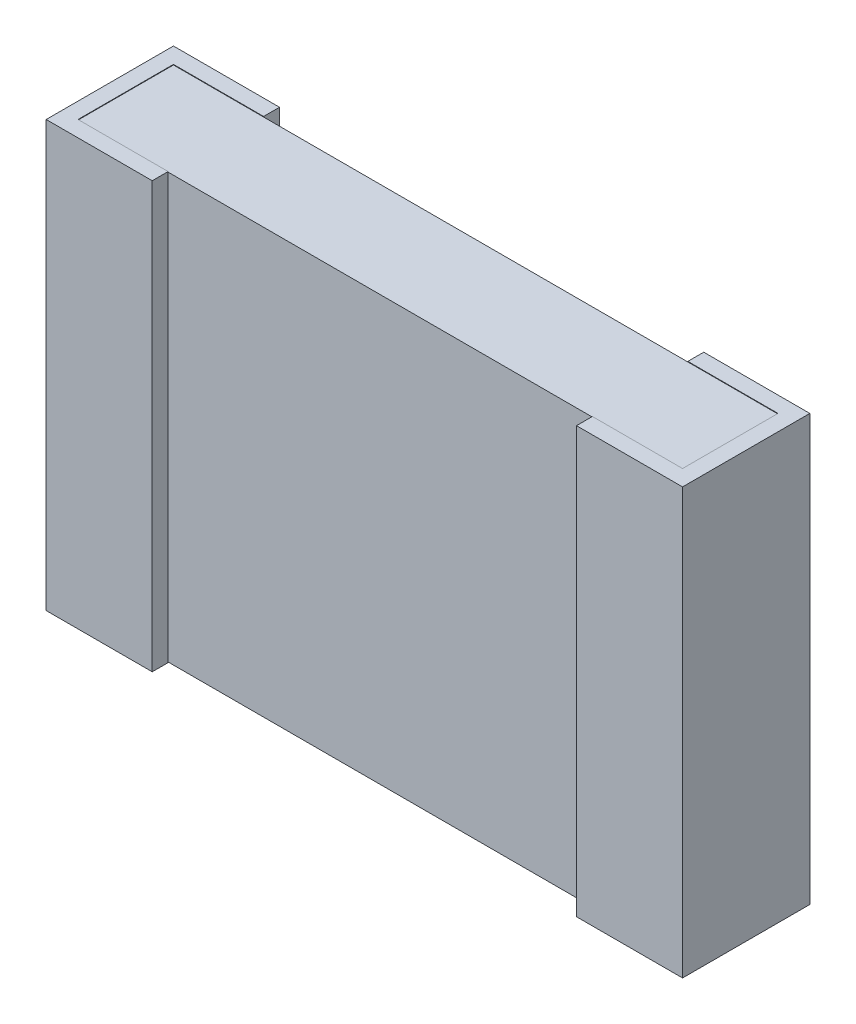
ISO-10303-21;
HEADER;
FILE_DESCRIPTION(('STEP AP214'),'2;1');
FILE_NAME('part.step','',(''),(''),'','','');
FILE_SCHEMA(('AUTOMOTIVE_DESIGN { 1 0 10303 214 1 1 1 1 }'));
ENDSEC;
DATA;
#1=APPLICATION_CONTEXT('core data for automotive mechanical design processes');
#2=APPLICATION_PROTOCOL_DEFINITION('international standard','automotive_design',2000,#1);
#3=PRODUCT_CONTEXT('',#1,'mechanical');
#4=PRODUCT('Part','Part','',(#3));
#5=PRODUCT_RELATED_PRODUCT_CATEGORY('part','',(#4));
#6=PRODUCT_DEFINITION_FORMATION('','',#4);
#7=PRODUCT_DEFINITION_CONTEXT('part definition',#1,'design');
#8=PRODUCT_DEFINITION('design','',#6,#7);
#9=PRODUCT_DEFINITION_SHAPE('','',#8);
#10=(LENGTH_UNIT() NAMED_UNIT(*) SI_UNIT(.MILLI.,.METRE.));
#11=(NAMED_UNIT(*) PLANE_ANGLE_UNIT() SI_UNIT($,.RADIAN.));
#12=(NAMED_UNIT(*) SI_UNIT($,.STERADIAN.) SOLID_ANGLE_UNIT());
#13=UNCERTAINTY_MEASURE_WITH_UNIT(LENGTH_MEASURE(1.E-05),#10,'distance_accuracy_value','');
#14=(GEOMETRIC_REPRESENTATION_CONTEXT(3) GLOBAL_UNCERTAINTY_ASSIGNED_CONTEXT((#13)) GLOBAL_UNIT_ASSIGNED_CONTEXT((#10,
#11,#12)) REPRESENTATION_CONTEXT('',''));
#15=CARTESIAN_POINT('',(0.,0.,0.));
#16=DIRECTION('',(0.,0.,1.));
#17=DIRECTION('',(1.,0.,0.));
#18=AXIS2_PLACEMENT_3D('',#15,#16,#17);
#19=CARTESIAN_POINT('',(0.,-1.01854,0.609599999999878));
#20=DIRECTION('',(0.,0.,1.));
#21=DIRECTION('',(1.,0.,0.));
#22=AXIS2_PLACEMENT_3D('',#19,#20,#21);
#23=PLANE('',#22);
#24=DIRECTION('',(1.,0.,0.));
#25=VECTOR('',#24,1.);
#26=CARTESIAN_POINT('',(0.,-1.01854,0.609599999999878));
#27=LINE('',#26,#25);
#28=CARTESIAN_POINT('',(0.,-1.01854,0.609599999999878));
#29=VERTEX_POINT('',#28);
#30=CARTESIAN_POINT('',(0.508,-1.01854,0.609599999999878));
#31=VERTEX_POINT('',#30);
#32=EDGE_CURVE('E190',#29,#31,#27,.T.);
#33=ORIENTED_EDGE('',*,*,#32,.T.);
#34=DIRECTION('',(0.,1.,0.));
#35=VECTOR('',#34,1.);
#36=CARTESIAN_POINT('',(0.508,-1.01854,0.609599999999878));
#37=LINE('',#36,#35);
#38=CARTESIAN_POINT('',(0.508,1.01854,0.609599999999878));
#39=VERTEX_POINT('',#38);
#40=EDGE_CURVE('E202',#39,#31,#37,.F.);
#41=ORIENTED_EDGE('',*,*,#40,.F.);
#42=DIRECTION('',(1.,0.,0.));
#43=VECTOR('',#42,1.);
#44=CARTESIAN_POINT('',(0.,1.01854,0.609599999999878));
#45=LINE('',#44,#43);
#46=CARTESIAN_POINT('',(0.,1.01854,0.609599999999878));
#47=VERTEX_POINT('',#46);
#48=EDGE_CURVE('E20',#39,#47,#45,.F.);
#49=ORIENTED_EDGE('',*,*,#48,.T.);
#50=DIRECTION('',(0.,1.,0.));
#51=VECTOR('',#50,1.);
#52=CARTESIAN_POINT('',(0.,-1.01854,0.609599999999878));
#53=LINE('',#52,#51);
#54=EDGE_CURVE('E205',#29,#47,#53,.T.);
#55=ORIENTED_EDGE('',*,*,#54,.F.);
#56=EDGE_LOOP('',(#33,#41,#49,#55));
#57=FACE_BOUND('',#56,.T.);
#58=ADVANCED_FACE('F17',(#57),#23,.T.);
#59=CARTESIAN_POINT('',(3.048,-1.01854,0.609599999999878));
#60=DIRECTION('',(0.,0.,-1.));
#61=DIRECTION('',(-1.,0.,0.));
#62=AXIS2_PLACEMENT_3D('',#59,#60,#61);
#63=PLANE('',#62);
#64=DIRECTION('',(0.,1.,0.));
#65=VECTOR('',#64,1.);
#66=CARTESIAN_POINT('',(2.54,-1.01854,0.609599999999878));
#67=LINE('',#66,#65);
#68=CARTESIAN_POINT('',(2.54,1.01854,0.609599999999878));
#69=VERTEX_POINT('',#68);
#70=CARTESIAN_POINT('',(2.54,-1.01854,0.609599999999878));
#71=VERTEX_POINT('',#70);
#72=EDGE_CURVE('E195',#69,#71,#67,.F.);
#73=ORIENTED_EDGE('',*,*,#72,.T.);
#74=DIRECTION('',(-1.,0.,0.));
#75=VECTOR('',#74,1.);
#76=CARTESIAN_POINT('',(3.048,-1.01854,0.609599999999878));
#77=LINE('',#76,#75);
#78=CARTESIAN_POINT('',(3.048,-1.01854,0.609599999999878));
#79=VERTEX_POINT('',#78);
#80=EDGE_CURVE('E181',#79,#71,#77,.T.);
#81=ORIENTED_EDGE('',*,*,#80,.F.);
#82=DIRECTION('',(0.,1.,0.));
#83=VECTOR('',#82,1.);
#84=CARTESIAN_POINT('',(3.048,-1.01854,0.609599999999878));
#85=LINE('',#84,#83);
#86=CARTESIAN_POINT('',(3.048,1.01854,0.609599999999878));
#87=VERTEX_POINT('',#86);
#88=EDGE_CURVE('E252',#79,#87,#85,.T.);
#89=ORIENTED_EDGE('',*,*,#88,.T.);
#90=DIRECTION('',(-1.,0.,0.));
#91=VECTOR('',#90,1.);
#92=CARTESIAN_POINT('',(3.048,1.01854,0.609599999999878));
#93=LINE('',#92,#91);
#94=EDGE_CURVE('E175',#69,#87,#93,.F.);
#95=ORIENTED_EDGE('',*,*,#94,.F.);
#96=EDGE_LOOP('',(#73,#81,#89,#95));
#97=FACE_BOUND('',#96,.T.);
#98=ADVANCED_FACE('F201',(#97),#63,.F.);
#99=CARTESIAN_POINT('',(0.,-1.01854,0.));
#100=DIRECTION('',(-1.,0.,0.));
#101=DIRECTION('',(0.,0.,1.));
#102=AXIS2_PLACEMENT_3D('',#99,#100,#101);
#103=PLANE('',#102);
#104=DIRECTION('',(0.,0.,1.));
#105=VECTOR('',#104,1.);
#106=CARTESIAN_POINT('',(0.,-1.01854,0.533400000000122));
#107=LINE('',#106,#105);
#108=CARTESIAN_POINT('',(0.,-1.01854,0.));
#109=VERTEX_POINT('',#108);
#110=EDGE_CURVE('E224',#109,#29,#107,.T.);
#111=ORIENTED_EDGE('',*,*,#110,.T.);
#112=ORIENTED_EDGE('',*,*,#54,.T.);
#113=DIRECTION('',(0.,0.,1.));
#114=VECTOR('',#113,1.);
#115=CARTESIAN_POINT('',(0.,1.01854,0.533400000000122));
#116=LINE('',#115,#114);
#117=CARTESIAN_POINT('',(0.,1.01854,0.));
#118=VERTEX_POINT('',#117);
#119=EDGE_CURVE('E222',#118,#47,#116,.T.);
#120=ORIENTED_EDGE('',*,*,#119,.F.);
#121=DIRECTION('',(0.,1.,0.));
#122=VECTOR('',#121,1.);
#123=CARTESIAN_POINT('',(0.,-1.01854,0.));
#124=LINE('',#123,#122);
#125=EDGE_CURVE('E363',#109,#118,#124,.T.);
#126=ORIENTED_EDGE('',*,*,#125,.F.);
#127=EDGE_LOOP('',(#111,#112,#120,#126));
#128=FACE_BOUND('',#127,.T.);
#129=ADVANCED_FACE('F220',(#128),#103,.T.);
#130=CARTESIAN_POINT('',(0.508,-1.01854,0.609599999999878));
#131=DIRECTION('',(1.,0.,0.));
#132=DIRECTION('',(0.,0.,-1.));
#133=AXIS2_PLACEMENT_3D('',#130,#131,#132);
#134=PLANE('',#133);
#135=DIRECTION('',(0.,1.,0.));
#136=VECTOR('',#135,1.);
#137=CARTESIAN_POINT('',(0.508,1.016,0.533400000000122));
#138=LINE('',#137,#136);
#139=CARTESIAN_POINT('',(0.508,-1.016,0.533400000000122));
#140=VERTEX_POINT('',#139);
#141=CARTESIAN_POINT('',(0.508,1.016,0.533400000000122));
#142=VERTEX_POINT('',#141);
#143=EDGE_CURVE('E268',#140,#142,#138,.T.);
#144=ORIENTED_EDGE('',*,*,#143,.T.);
#145=DIRECTION('',(0.,1.,0.));
#146=VECTOR('',#145,1.);
#147=CARTESIAN_POINT('',(0.508,-1.01854,0.533400000000122));
#148=LINE('',#147,#146);
#149=CARTESIAN_POINT('',(0.508,1.01854,0.533400000000122));
#150=VERTEX_POINT('',#149);
#151=EDGE_CURVE('E248',#142,#150,#148,.T.);
#152=ORIENTED_EDGE('',*,*,#151,.T.);
#153=DIRECTION('',(0.,0.,1.));
#154=VECTOR('',#153,1.);
#155=CARTESIAN_POINT('',(0.508,1.01854,0.533400000000122));
#156=LINE('',#155,#154);
#157=EDGE_CURVE('E229',#39,#150,#156,.F.);
#158=ORIENTED_EDGE('',*,*,#157,.F.);
#159=ORIENTED_EDGE('',*,*,#40,.T.);
#160=DIRECTION('',(0.,0.,1.));
#161=VECTOR('',#160,1.);
#162=CARTESIAN_POINT('',(0.508,-1.01854,0.533400000000122));
#163=LINE('',#162,#161);
#164=CARTESIAN_POINT('',(0.508,-1.01854,0.533400000000122));
#165=VERTEX_POINT('',#164);
#166=EDGE_CURVE('E369',#31,#165,#163,.F.);
#167=ORIENTED_EDGE('',*,*,#166,.T.);
#168=DIRECTION('',(0.,1.,0.));
#169=VECTOR('',#168,1.);
#170=CARTESIAN_POINT('',(0.508,-1.01854,0.533400000000122));
#171=LINE('',#170,#169);
#172=EDGE_CURVE('E358',#165,#140,#171,.T.);
#173=ORIENTED_EDGE('',*,*,#172,.T.);
#174=EDGE_LOOP('',(#144,#152,#158,#159,#167,#173));
#175=FACE_BOUND('',#174,.T.);
#176=ADVANCED_FACE('F445',(#175),#134,.T.);
#177=CARTESIAN_POINT('',(2.54,-1.01854,0.609599999999878));
#178=DIRECTION('',(1.,0.,0.));
#179=DIRECTION('',(0.,0.,-1.));
#180=AXIS2_PLACEMENT_3D('',#177,#178,#179);
#181=PLANE('',#180);
#182=DIRECTION('',(0.,1.,0.));
#183=VECTOR('',#182,1.);
#184=CARTESIAN_POINT('',(2.54,-1.01854,0.533400000000122));
#185=LINE('',#184,#183);
#186=CARTESIAN_POINT('',(2.54,1.016,0.533400000000122));
#187=VERTEX_POINT('',#186);
#188=CARTESIAN_POINT('',(2.54,1.01854,0.533400000000122));
#189=VERTEX_POINT('',#188);
#190=EDGE_CURVE('E242',#187,#189,#185,.T.);
#191=ORIENTED_EDGE('',*,*,#190,.F.);
#192=DIRECTION('',(0.,1.,0.));
#193=VECTOR('',#192,1.);
#194=CARTESIAN_POINT('',(2.54,1.016,0.533400000000122));
#195=LINE('',#194,#193);
#196=CARTESIAN_POINT('',(2.54,-1.016,0.533400000000122));
#197=VERTEX_POINT('',#196);
#198=EDGE_CURVE('E261',#187,#197,#195,.F.);
#199=ORIENTED_EDGE('',*,*,#198,.T.);
#200=DIRECTION('',(0.,1.,0.));
#201=VECTOR('',#200,1.);
#202=CARTESIAN_POINT('',(2.54,-1.01854,0.533400000000122));
#203=LINE('',#202,#201);
#204=CARTESIAN_POINT('',(2.54,-1.01854,0.533400000000122));
#205=VERTEX_POINT('',#204);
#206=EDGE_CURVE('E198',#205,#197,#203,.T.);
#207=ORIENTED_EDGE('',*,*,#206,.F.);
#208=DIRECTION('',(0.,0.,-1.));
#209=VECTOR('',#208,1.);
#210=CARTESIAN_POINT('',(2.54,-1.01854,0.609599999999878));
#211=LINE('',#210,#209);
#212=EDGE_CURVE('E186',#71,#205,#211,.T.);
#213=ORIENTED_EDGE('',*,*,#212,.F.);
#214=ORIENTED_EDGE('',*,*,#72,.F.);
#215=DIRECTION('',(0.,0.,-1.));
#216=VECTOR('',#215,1.);
#217=CARTESIAN_POINT('',(2.54,1.01854,0.609599999999878));
#218=LINE('',#217,#216);
#219=EDGE_CURVE('E254',#189,#69,#218,.F.);
#220=ORIENTED_EDGE('',*,*,#219,.F.);
#221=EDGE_LOOP('',(#191,#199,#207,#213,#214,#220));
#222=FACE_BOUND('',#221,.T.);
#223=ADVANCED_FACE('F194',(#222),#181,.F.);
#224=CARTESIAN_POINT('',(3.048,-1.01854,0.));
#225=DIRECTION('',(-1.,0.,0.));
#226=DIRECTION('',(0.,0.,1.));
#227=AXIS2_PLACEMENT_3D('',#224,#225,#226);
#228=PLANE('',#227);
#229=ORIENTED_EDGE('',*,*,#88,.F.);
#230=DIRECTION('',(0.,0.,1.));
#231=VECTOR('',#230,1.);
#232=CARTESIAN_POINT('',(3.048,-1.01854,0.533400000000122));
#233=LINE('',#232,#231);
#234=CARTESIAN_POINT('',(3.048,-1.01854,0.));
#235=VERTEX_POINT('',#234);
#236=EDGE_CURVE('E188',#79,#235,#233,.F.);
#237=ORIENTED_EDGE('',*,*,#236,.T.);
#238=DIRECTION('',(0.,1.,0.));
#239=VECTOR('',#238,1.);
#240=CARTESIAN_POINT('',(3.048,-1.01854,0.));
#241=LINE('',#240,#239);
#242=CARTESIAN_POINT('',(3.048,1.01854,0.));
#243=VERTEX_POINT('',#242);
#244=EDGE_CURVE('E327',#235,#243,#241,.T.);
#245=ORIENTED_EDGE('',*,*,#244,.T.);
#246=DIRECTION('',(0.,0.,1.));
#247=VECTOR('',#246,1.);
#248=CARTESIAN_POINT('',(3.048,1.01854,0.));
#249=LINE('',#248,#247);
#250=EDGE_CURVE('E250',#87,#243,#249,.F.);
#251=ORIENTED_EDGE('',*,*,#250,.F.);
#252=EDGE_LOOP('',(#229,#237,#245,#251));
#253=FACE_BOUND('',#252,.T.);
#254=ADVANCED_FACE('F683',(#253),#228,.F.);
#255=CARTESIAN_POINT('',(0.0762000000000002,-1.01854,0.0762000000001224));
#256=DIRECTION('',(-1.,0.,0.));
#257=DIRECTION('',(0.,0.,1.));
#258=AXIS2_PLACEMENT_3D('',#255,#256,#257);
#259=PLANE('',#258);
#260=DIRECTION('',(0.,1.,0.));
#261=VECTOR('',#260,1.);
#262=CARTESIAN_POINT('',(0.0762000000000002,-1.01854,0.0762000000001224));
#263=LINE('',#262,#261);
#264=CARTESIAN_POINT('',(0.0762000000000002,1.016,0.0762000000001224));
#265=VERTEX_POINT('',#264);
#266=CARTESIAN_POINT('',(0.0762000000000002,1.01854,0.0762000000001224));
#267=VERTEX_POINT('',#266);
#268=EDGE_CURVE('E232',#265,#267,#263,.T.);
#269=ORIENTED_EDGE('',*,*,#268,.T.);
#270=DIRECTION('',(0.,0.,1.));
#271=VECTOR('',#270,1.);
#272=CARTESIAN_POINT('',(0.0762,1.01854,0.533400000000122));
#273=LINE('',#272,#271);
#274=CARTESIAN_POINT('',(0.0762,1.01854,0.533400000000122));
#275=VERTEX_POINT('',#274);
#276=EDGE_CURVE('E230',#275,#267,#273,.F.);
#277=ORIENTED_EDGE('',*,*,#276,.F.);
#278=DIRECTION('',(0.,1.,0.));
#279=VECTOR('',#278,1.);
#280=CARTESIAN_POINT('',(0.0762,-1.01854,0.533400000000122));
#281=LINE('',#280,#279);
#282=CARTESIAN_POINT('',(0.0762000000000001,1.016,0.533400000000122));
#283=VERTEX_POINT('',#282);
#284=EDGE_CURVE('E245',#275,#283,#281,.F.);
#285=ORIENTED_EDGE('',*,*,#284,.T.);
#286=DIRECTION('',(0.,0.,1.));
#287=VECTOR('',#286,1.);
#288=CARTESIAN_POINT('',(0.0762000000000002,1.016,0.0762000000001225));
#289=LINE('',#288,#287);
#290=EDGE_CURVE('E314',#265,#283,#289,.T.);
#291=ORIENTED_EDGE('',*,*,#290,.F.);
#292=EDGE_LOOP('',(#269,#277,#285,#291));
#293=FACE_BOUND('',#292,.T.);
#294=ADVANCED_FACE('F378',(#293),#259,.F.);
#295=CARTESIAN_POINT('',(0.0762,-1.01854,0.533400000000122));
#296=DIRECTION('',(0.,0.,1.));
#297=DIRECTION('',(1.,0.,0.));
#298=AXIS2_PLACEMENT_3D('',#295,#296,#297);
#299=PLANE('',#298);
#300=ORIENTED_EDGE('',*,*,#284,.F.);
#301=DIRECTION('',(1.,0.,0.));
#302=VECTOR('',#301,1.);
#303=CARTESIAN_POINT('',(0.508,1.01854,0.533400000000122));
#304=LINE('',#303,#302);
#305=EDGE_CURVE('E234',#150,#275,#304,.F.);
#306=ORIENTED_EDGE('',*,*,#305,.F.);
#307=ORIENTED_EDGE('',*,*,#151,.F.);
#308=DIRECTION('',(1.,0.,0.));
#309=VECTOR('',#308,1.);
#310=CARTESIAN_POINT('',(0.0762000000000002,1.016,0.533400000000122));
#311=LINE('',#310,#309);
#312=EDGE_CURVE('E311',#283,#142,#311,.T.);
#313=ORIENTED_EDGE('',*,*,#312,.F.);
#314=EDGE_LOOP('',(#300,#306,#307,#313));
#315=FACE_BOUND('',#314,.T.);
#316=ADVANCED_FACE('F442',(#315),#299,.F.);
#317=CARTESIAN_POINT('',(2.9718,-1.01854,0.533400000000122));
#318=DIRECTION('',(0.,0.,-1.));
#319=DIRECTION('',(-1.,0.,0.));
#320=AXIS2_PLACEMENT_3D('',#317,#318,#319);
#321=PLANE('',#320);
#322=ORIENTED_EDGE('',*,*,#190,.T.);
#323=DIRECTION('',(1.,0.,0.));
#324=VECTOR('',#323,1.);
#325=CARTESIAN_POINT('',(2.54,1.01854,0.533400000000122));
#326=LINE('',#325,#324);
#327=CARTESIAN_POINT('',(2.9718,1.01854,0.533400000000122));
#328=VERTEX_POINT('',#327);
#329=EDGE_CURVE('E324',#328,#189,#326,.F.);
#330=ORIENTED_EDGE('',*,*,#329,.F.);
#331=DIRECTION('',(0.,1.,0.));
#332=VECTOR('',#331,1.);
#333=CARTESIAN_POINT('',(2.9718,-1.01854,0.533400000000122));
#334=LINE('',#333,#332);
#335=CARTESIAN_POINT('',(2.9718,1.016,0.533400000000122));
#336=VERTEX_POINT('',#335);
#337=EDGE_CURVE('E240',#336,#328,#334,.T.);
#338=ORIENTED_EDGE('',*,*,#337,.F.);
#339=DIRECTION('',(1.,0.,0.));
#340=VECTOR('',#339,1.);
#341=CARTESIAN_POINT('',(0.0762000000000002,1.016,0.533400000000122));
#342=LINE('',#341,#340);
#343=EDGE_CURVE('E307',#187,#336,#342,.T.);
#344=ORIENTED_EDGE('',*,*,#343,.F.);
#345=EDGE_LOOP('',(#322,#330,#338,#344));
#346=FACE_BOUND('',#345,.T.);
#347=ADVANCED_FACE('F656',(#346),#321,.T.);
#348=CARTESIAN_POINT('',(2.9718,-1.01854,0.0762000000001224));
#349=DIRECTION('',(-1.,0.,0.));
#350=DIRECTION('',(0.,0.,1.));
#351=AXIS2_PLACEMENT_3D('',#348,#349,#350);
#352=PLANE('',#351);
#353=ORIENTED_EDGE('',*,*,#337,.T.);
#354=DIRECTION('',(0.,0.,1.));
#355=VECTOR('',#354,1.);
#356=CARTESIAN_POINT('',(2.9718,1.01854,0.533400000000122));
#357=LINE('',#356,#355);
#358=CARTESIAN_POINT('',(2.9718,1.01854,0.0762000000001224));
#359=VERTEX_POINT('',#358);
#360=EDGE_CURVE('E316',#359,#328,#357,.T.);
#361=ORIENTED_EDGE('',*,*,#360,.F.);
#362=DIRECTION('',(0.,1.,0.));
#363=VECTOR('',#362,1.);
#364=CARTESIAN_POINT('',(2.9718,-1.01854,0.0762000000001224));
#365=LINE('',#364,#363);
#366=CARTESIAN_POINT('',(2.9718,1.016,0.0762000000001225));
#367=VERTEX_POINT('',#366);
#368=EDGE_CURVE('E342',#367,#359,#365,.T.);
#369=ORIENTED_EDGE('',*,*,#368,.F.);
#370=DIRECTION('',(0.,0.,1.));
#371=VECTOR('',#370,1.);
#372=CARTESIAN_POINT('',(2.9718,1.016,0.0762000000001225));
#373=LINE('',#372,#371);
#374=EDGE_CURVE('E305',#336,#367,#373,.F.);
#375=ORIENTED_EDGE('',*,*,#374,.F.);
#376=EDGE_LOOP('',(#353,#361,#369,#375));
#377=FACE_BOUND('',#376,.T.);
#378=ADVANCED_FACE('F647',(#377),#352,.T.);
#379=CARTESIAN_POINT('',(0.508,1.01854,0.533400000000122));
#380=DIRECTION('',(0.,1.,0.));
#381=DIRECTION('',(0.,0.,1.));
#382=AXIS2_PLACEMENT_3D('',#379,#380,#381);
#383=PLANE('',#382);
#384=ORIENTED_EDGE('',*,*,#48,.F.);
#385=ORIENTED_EDGE('',*,*,#157,.T.);
#386=ORIENTED_EDGE('',*,*,#305,.T.);
#387=ORIENTED_EDGE('',*,*,#276,.T.);
#388=DIRECTION('',(-1.,0.,0.));
#389=VECTOR('',#388,1.);
#390=CARTESIAN_POINT('',(0.507999999999976,1.01854,0.0762000000001225));
#391=LINE('',#390,#389);
#392=CARTESIAN_POINT('',(0.507999999999976,1.01854,0.0762000000001224));
#393=VERTEX_POINT('',#392);
#394=EDGE_CURVE('E372',#267,#393,#391,.F.);
#395=ORIENTED_EDGE('',*,*,#394,.T.);
#396=DIRECTION('',(0.,0.,-1.));
#397=VECTOR('',#396,1.);
#398=CARTESIAN_POINT('',(0.507999999999976,1.01854,0.0762000000001225));
#399=LINE('',#398,#397);
#400=CARTESIAN_POINT('',(0.507999999999976,1.01854,0.));
#401=VERTEX_POINT('',#400);
#402=EDGE_CURVE('E298',#401,#393,#399,.F.);
#403=ORIENTED_EDGE('',*,*,#402,.F.);
#404=DIRECTION('',(-1.,0.,0.));
#405=VECTOR('',#404,1.);
#406=CARTESIAN_POINT('',(0.507999999999976,1.01854,0.));
#407=LINE('',#406,#405);
#408=EDGE_CURVE('E228',#118,#401,#407,.F.);
#409=ORIENTED_EDGE('',*,*,#408,.F.);
#410=ORIENTED_EDGE('',*,*,#119,.T.);
#411=EDGE_LOOP('',(#384,#385,#386,#387,#395,#403,#409,#410));
#412=FACE_BOUND('',#411,.T.);
#413=ADVANCED_FACE('F226',(#412),#383,.T.);
#414=CARTESIAN_POINT('',(0.507999999999976,-1.01854,0.0762000000001225));
#415=DIRECTION('',(0.,0.,-1.));
#416=DIRECTION('',(-1.,0.,0.));
#417=AXIS2_PLACEMENT_3D('',#414,#415,#416);
#418=PLANE('',#417);
#419=DIRECTION('',(0.,1.,0.));
#420=VECTOR('',#419,1.);
#421=CARTESIAN_POINT('',(0.507999999999976,-1.01854,0.0762000000001225));
#422=LINE('',#421,#420);
#423=CARTESIAN_POINT('',(0.507999999999976,1.016,0.0762000000001225));
#424=VERTEX_POINT('',#423);
#425=EDGE_CURVE('E296',#393,#424,#422,.F.);
#426=ORIENTED_EDGE('',*,*,#425,.F.);
#427=ORIENTED_EDGE('',*,*,#394,.F.);
#428=ORIENTED_EDGE('',*,*,#268,.F.);
#429=DIRECTION('',(1.,0.,0.));
#430=VECTOR('',#429,1.);
#431=CARTESIAN_POINT('',(0.0762000000000002,1.016,0.0762000000001225));
#432=LINE('',#431,#430);
#433=EDGE_CURVE('E300',#424,#265,#432,.F.);
#434=ORIENTED_EDGE('',*,*,#433,.F.);
#435=EDGE_LOOP('',(#426,#427,#428,#434));
#436=FACE_BOUND('',#435,.T.);
#437=ADVANCED_FACE('F383',(#436),#418,.F.);
#438=CARTESIAN_POINT('',(0.508,-1.01854,0.533400000000122));
#439=DIRECTION('',(0.,1.,0.));
#440=DIRECTION('',(0.,0.,1.));
#441=AXIS2_PLACEMENT_3D('',#438,#439,#440);
#442=PLANE('',#441);
#443=ORIENTED_EDGE('',*,*,#166,.F.);
#444=ORIENTED_EDGE('',*,*,#32,.F.);
#445=ORIENTED_EDGE('',*,*,#110,.F.);
#446=DIRECTION('',(-1.,0.,0.));
#447=VECTOR('',#446,1.);
#448=CARTESIAN_POINT('',(0.507999999999976,-1.01854,0.));
#449=LINE('',#448,#447);
#450=CARTESIAN_POINT('',(0.507999999999976,-1.01854,0.));
#451=VERTEX_POINT('',#450);
#452=EDGE_CURVE('E365',#451,#109,#449,.T.);
#453=ORIENTED_EDGE('',*,*,#452,.F.);
#454=DIRECTION('',(0.,0.,-1.));
#455=VECTOR('',#454,1.);
#456=CARTESIAN_POINT('',(0.507999999999976,-1.01854,0.0762000000001225));
#457=LINE('',#456,#455);
#458=CARTESIAN_POINT('',(0.507999999999976,-1.01854,0.0762000000001225));
#459=VERTEX_POINT('',#458);
#460=EDGE_CURVE('E291',#459,#451,#457,.T.);
#461=ORIENTED_EDGE('',*,*,#460,.F.);
#462=DIRECTION('',(-1.,0.,0.));
#463=VECTOR('',#462,1.);
#464=CARTESIAN_POINT('',(0.507999999999976,-1.01854,0.0762000000001225));
#465=LINE('',#464,#463);
#466=CARTESIAN_POINT('',(0.0762000000000001,-1.01854,0.0762000000001224));
#467=VERTEX_POINT('',#466);
#468=EDGE_CURVE('E353',#459,#467,#465,.T.);
#469=ORIENTED_EDGE('',*,*,#468,.T.);
#470=DIRECTION('',(0.,0.,1.));
#471=VECTOR('',#470,1.);
#472=CARTESIAN_POINT('',(0.0762000000000002,-1.01854,0.0762000000001224));
#473=LINE('',#472,#471);
#474=CARTESIAN_POINT('',(0.0762,-1.01854,0.533400000000122));
#475=VERTEX_POINT('',#474);
#476=EDGE_CURVE('E350',#467,#475,#473,.T.);
#477=ORIENTED_EDGE('',*,*,#476,.T.);
#478=DIRECTION('',(1.,0.,0.));
#479=VECTOR('',#478,1.);
#480=CARTESIAN_POINT('',(0.0762,-1.01854,0.533400000000122));
#481=LINE('',#480,#479);
#482=EDGE_CURVE('E360',#475,#165,#481,.T.);
#483=ORIENTED_EDGE('',*,*,#482,.T.);
#484=EDGE_LOOP('',(#443,#444,#445,#453,#461,#469,#477,#483));
#485=FACE_BOUND('',#484,.T.);
#486=ADVANCED_FACE('F436',(#485),#442,.F.);
#487=CARTESIAN_POINT('',(0.507999999999976,-1.01854,0.));
#488=DIRECTION('',(0.,0.,-1.));
#489=DIRECTION('',(-1.,0.,0.));
#490=AXIS2_PLACEMENT_3D('',#487,#488,#489);
#491=PLANE('',#490);
#492=ORIENTED_EDGE('',*,*,#452,.T.);
#493=ORIENTED_EDGE('',*,*,#125,.T.);
#494=ORIENTED_EDGE('',*,*,#408,.T.);
#495=DIRECTION('',(0.,1.,0.));
#496=VECTOR('',#495,1.);
#497=CARTESIAN_POINT('',(0.507999999999976,-1.01854,0.));
#498=LINE('',#497,#496);
#499=EDGE_CURVE('E285',#451,#401,#498,.T.);
#500=ORIENTED_EDGE('',*,*,#499,.F.);
#501=EDGE_LOOP('',(#492,#493,#494,#500));
#502=FACE_BOUND('',#501,.T.);
#503=ADVANCED_FACE('F439',(#502),#491,.T.);
#504=CARTESIAN_POINT('',(0.0762,-1.01854,0.533400000000122));
#505=DIRECTION('',(0.,0.,1.));
#506=DIRECTION('',(1.,0.,0.));
#507=AXIS2_PLACEMENT_3D('',#504,#505,#506);
#508=PLANE('',#507);
#509=DIRECTION('',(1.,0.,0.));
#510=VECTOR('',#509,1.);
#511=CARTESIAN_POINT('',(0.0762000000000002,-1.016,0.533400000000122));
#512=LINE('',#511,#510);
#513=CARTESIAN_POINT('',(0.0762000000000001,-1.016,0.533400000000122));
#514=VERTEX_POINT('',#513);
#515=EDGE_CURVE('E283',#514,#140,#512,.T.);
#516=ORIENTED_EDGE('',*,*,#515,.T.);
#517=ORIENTED_EDGE('',*,*,#172,.F.);
#518=ORIENTED_EDGE('',*,*,#482,.F.);
#519=DIRECTION('',(0.,1.,0.));
#520=VECTOR('',#519,1.);
#521=CARTESIAN_POINT('',(0.0762,-1.01854,0.533400000000122));
#522=LINE('',#521,#520);
#523=EDGE_CURVE('E347',#475,#514,#522,.T.);
#524=ORIENTED_EDGE('',*,*,#523,.T.);
#525=EDGE_LOOP('',(#516,#517,#518,#524));
#526=FACE_BOUND('',#525,.T.);
#527=ADVANCED_FACE('F448',(#526),#508,.F.);
#528=CARTESIAN_POINT('',(0.0762,1.016,0.533400000000122));
#529=DIRECTION('',(0.,0.,-1.));
#530=DIRECTION('',(-1.,0.,0.));
#531=AXIS2_PLACEMENT_3D('',#528,#529,#530);
#532=PLANE('',#531);
#533=DIRECTION('',(1.,0.,0.));
#534=VECTOR('',#533,1.);
#535=CARTESIAN_POINT('',(0.0762000000000002,1.016,0.533400000000122));
#536=LINE('',#535,#534);
#537=EDGE_CURVE('E309',#142,#187,#536,.T.);
#538=ORIENTED_EDGE('',*,*,#537,.F.);
#539=ORIENTED_EDGE('',*,*,#143,.F.);
#540=DIRECTION('',(1.,0.,0.));
#541=VECTOR('',#540,1.);
#542=CARTESIAN_POINT('',(0.0762000000000002,-1.016,0.533400000000122));
#543=LINE('',#542,#541);
#544=EDGE_CURVE('E274',#140,#197,#543,.T.);
#545=ORIENTED_EDGE('',*,*,#544,.T.);
#546=ORIENTED_EDGE('',*,*,#198,.F.);
#547=EDGE_LOOP('',(#538,#539,#545,#546));
#548=FACE_BOUND('',#547,.T.);
#549=ADVANCED_FACE('F280',(#548),#532,.F.);
#550=CARTESIAN_POINT('',(2.9718,-1.01854,0.533400000000122));
#551=DIRECTION('',(0.,0.,-1.));
#552=DIRECTION('',(-1.,0.,0.));
#553=AXIS2_PLACEMENT_3D('',#550,#551,#552);
#554=PLANE('',#553);
#555=DIRECTION('',(1.,0.,0.));
#556=VECTOR('',#555,1.);
#557=CARTESIAN_POINT('',(2.54,-1.01854,0.533400000000122));
#558=LINE('',#557,#556);
#559=CARTESIAN_POINT('',(2.9718,-1.01854,0.533400000000122));
#560=VERTEX_POINT('',#559);
#561=EDGE_CURVE('E260',#560,#205,#558,.F.);
#562=ORIENTED_EDGE('',*,*,#561,.T.);
#563=ORIENTED_EDGE('',*,*,#206,.T.);
#564=DIRECTION('',(1.,0.,0.));
#565=VECTOR('',#564,1.);
#566=CARTESIAN_POINT('',(0.0762000000000002,-1.016,0.533400000000122));
#567=LINE('',#566,#565);
#568=CARTESIAN_POINT('',(2.9718,-1.016,0.533400000000122));
#569=VERTEX_POINT('',#568);
#570=EDGE_CURVE('E259',#197,#569,#567,.T.);
#571=ORIENTED_EDGE('',*,*,#570,.T.);
#572=DIRECTION('',(0.,1.,0.));
#573=VECTOR('',#572,1.);
#574=CARTESIAN_POINT('',(2.9718,-1.01854,0.533400000000122));
#575=LINE('',#574,#573);
#576=EDGE_CURVE('E267',#560,#569,#575,.T.);
#577=ORIENTED_EDGE('',*,*,#576,.F.);
#578=EDGE_LOOP('',(#562,#563,#571,#577));
#579=FACE_BOUND('',#578,.T.);
#580=ADVANCED_FACE('F257',(#579),#554,.T.);
#581=CARTESIAN_POINT('',(2.9718,-1.01854,0.0762000000001224));
#582=DIRECTION('',(-1.,0.,0.));
#583=DIRECTION('',(0.,0.,1.));
#584=AXIS2_PLACEMENT_3D('',#581,#582,#583);
#585=PLANE('',#584);
#586=DIRECTION('',(0.,0.,1.));
#587=VECTOR('',#586,1.);
#588=CARTESIAN_POINT('',(2.9718,-1.01854,0.533400000000122));
#589=LINE('',#588,#587);
#590=CARTESIAN_POINT('',(2.9718,-1.01854,0.0762000000001225));
#591=VERTEX_POINT('',#590);
#592=EDGE_CURVE('E333',#591,#560,#589,.T.);
#593=ORIENTED_EDGE('',*,*,#592,.T.);
#594=ORIENTED_EDGE('',*,*,#576,.T.);
#595=DIRECTION('',(0.,0.,1.));
#596=VECTOR('',#595,1.);
#597=CARTESIAN_POINT('',(2.9718,-1.016,0.0762000000001225));
#598=LINE('',#597,#596);
#599=CARTESIAN_POINT('',(2.9718,-1.016,0.0762000000001227));
#600=VERTEX_POINT('',#599);
#601=EDGE_CURVE('E278',#569,#600,#598,.F.);
#602=ORIENTED_EDGE('',*,*,#601,.T.);
#603=DIRECTION('',(0.,1.,0.));
#604=VECTOR('',#603,1.);
#605=CARTESIAN_POINT('',(2.9718,-1.01854,0.0762000000001224));
#606=LINE('',#605,#604);
#607=EDGE_CURVE('E340',#591,#600,#606,.T.);
#608=ORIENTED_EDGE('',*,*,#607,.F.);
#609=EDGE_LOOP('',(#593,#594,#602,#608));
#610=FACE_BOUND('',#609,.T.);
#611=ADVANCED_FACE('F420',(#610),#585,.T.);
#612=CARTESIAN_POINT('',(0.507999999999976,-1.01854,0.0762000000001225));
#613=DIRECTION('',(0.,0.,-1.));
#614=DIRECTION('',(-1.,0.,0.));
#615=AXIS2_PLACEMENT_3D('',#612,#613,#614);
#616=PLANE('',#615);
#617=DIRECTION('',(1.,0.,0.));
#618=VECTOR('',#617,1.);
#619=CARTESIAN_POINT('',(0.0762000000000002,-1.016,0.0762000000001225));
#620=LINE('',#619,#618);
#621=CARTESIAN_POINT('',(0.507999999999976,-1.016,0.0762000000001225));
#622=VERTEX_POINT('',#621);
#623=CARTESIAN_POINT('',(0.0762000000000002,-1.016,0.0762000000001224));
#624=VERTEX_POINT('',#623);
#625=EDGE_CURVE('E415',#622,#624,#620,.F.);
#626=ORIENTED_EDGE('',*,*,#625,.T.);
#627=DIRECTION('',(0.,1.,0.));
#628=VECTOR('',#627,1.);
#629=CARTESIAN_POINT('',(0.0762000000000002,-1.01854,0.0762000000001225));
#630=LINE('',#629,#628);
#631=EDGE_CURVE('E344',#624,#467,#630,.F.);
#632=ORIENTED_EDGE('',*,*,#631,.T.);
#633=ORIENTED_EDGE('',*,*,#468,.F.);
#634=DIRECTION('',(0.,1.,0.));
#635=VECTOR('',#634,1.);
#636=CARTESIAN_POINT('',(0.507999999999976,-1.01854,0.0762000000001225));
#637=LINE('',#636,#635);
#638=EDGE_CURVE('E293',#622,#459,#637,.F.);
#639=ORIENTED_EDGE('',*,*,#638,.F.);
#640=EDGE_LOOP('',(#626,#632,#633,#639));
#641=FACE_BOUND('',#640,.T.);
#642=ADVANCED_FACE('F429',(#641),#616,.F.);
#643=CARTESIAN_POINT('',(0.0762000000000002,-1.01854,0.0762000000001224));
#644=DIRECTION('',(-1.,0.,0.));
#645=DIRECTION('',(0.,0.,1.));
#646=AXIS2_PLACEMENT_3D('',#643,#644,#645);
#647=PLANE('',#646);
#648=DIRECTION('',(0.,0.,1.));
#649=VECTOR('',#648,1.);
#650=CARTESIAN_POINT('',(0.0762000000000002,-1.016,0.0762000000001225));
#651=LINE('',#650,#649);
#652=EDGE_CURVE('E412',#624,#514,#651,.T.);
#653=ORIENTED_EDGE('',*,*,#652,.T.);
#654=ORIENTED_EDGE('',*,*,#523,.F.);
#655=ORIENTED_EDGE('',*,*,#476,.F.);
#656=ORIENTED_EDGE('',*,*,#631,.F.);
#657=EDGE_LOOP('',(#653,#654,#655,#656));
#658=FACE_BOUND('',#657,.T.);
#659=ADVANCED_FACE('F451',(#658),#647,.F.);
#660=CARTESIAN_POINT('',(2.54000000000002,-1.01854,0.0762000000001225));
#661=DIRECTION('',(0.,0.,1.));
#662=DIRECTION('',(1.,0.,0.));
#663=AXIS2_PLACEMENT_3D('',#660,#661,#662);
#664=PLANE('',#663);
#665=ORIENTED_EDGE('',*,*,#368,.T.);
#666=DIRECTION('',(1.,0.,0.));
#667=VECTOR('',#666,1.);
#668=CARTESIAN_POINT('',(2.54,1.01854,0.0762000000001225));
#669=LINE('',#668,#667);
#670=CARTESIAN_POINT('',(2.54000000000002,1.01854,0.0762000000001225));
#671=VERTEX_POINT('',#670);
#672=EDGE_CURVE('E319',#671,#359,#669,.T.);
#673=ORIENTED_EDGE('',*,*,#672,.F.);
#674=DIRECTION('',(0.,1.,0.));
#675=VECTOR('',#674,1.);
#676=CARTESIAN_POINT('',(2.54000000000002,-1.01854,0.0762000000001225));
#677=LINE('',#676,#675);
#678=CARTESIAN_POINT('',(2.54000000000002,1.016,0.0762000000001226));
#679=VERTEX_POINT('',#678);
#680=EDGE_CURVE('E410',#671,#679,#677,.F.);
#681=ORIENTED_EDGE('',*,*,#680,.T.);
#682=DIRECTION('',(1.,0.,0.));
#683=VECTOR('',#682,1.);
#684=CARTESIAN_POINT('',(0.0762000000000002,1.016,0.0762000000001228));
#685=LINE('',#684,#683);
#686=EDGE_CURVE('E303',#367,#679,#685,.F.);
#687=ORIENTED_EDGE('',*,*,#686,.F.);
#688=EDGE_LOOP('',(#665,#673,#681,#687));
#689=FACE_BOUND('',#688,.T.);
#690=ADVANCED_FACE('F453',(#689),#664,.T.);
#691=CARTESIAN_POINT('',(2.54000000000002,-1.01854,0.0762000000001225));
#692=DIRECTION('',(0.,0.,1.));
#693=DIRECTION('',(1.,0.,0.));
#694=AXIS2_PLACEMENT_3D('',#691,#692,#693);
#695=PLANE('',#694);
#696=DIRECTION('',(1.,0.,0.));
#697=VECTOR('',#696,1.);
#698=CARTESIAN_POINT('',(2.54,-1.01854,0.0762000000001225));
#699=LINE('',#698,#697);
#700=CARTESIAN_POINT('',(2.54000000000002,-1.01854,0.0762000000001225));
#701=VERTEX_POINT('',#700);
#702=EDGE_CURVE('E336',#701,#591,#699,.T.);
#703=ORIENTED_EDGE('',*,*,#702,.T.);
#704=ORIENTED_EDGE('',*,*,#607,.T.);
#705=DIRECTION('',(1.,0.,0.));
#706=VECTOR('',#705,1.);
#707=CARTESIAN_POINT('',(0.0762000000000002,-1.016,0.0762000000001228));
#708=LINE('',#707,#706);
#709=CARTESIAN_POINT('',(2.54000000000002,-1.016,0.0762000000001225));
#710=VERTEX_POINT('',#709);
#711=EDGE_CURVE('E418',#600,#710,#708,.F.);
#712=ORIENTED_EDGE('',*,*,#711,.T.);
#713=DIRECTION('',(0.,1.,0.));
#714=VECTOR('',#713,1.);
#715=CARTESIAN_POINT('',(2.54000000000002,-1.01854,0.0762000000001225));
#716=LINE('',#715,#714);
#717=EDGE_CURVE('E34',#710,#701,#716,.F.);
#718=ORIENTED_EDGE('',*,*,#717,.T.);
#719=EDGE_LOOP('',(#703,#704,#712,#718));
#720=FACE_BOUND('',#719,.T.);
#721=ADVANCED_FACE('F422',(#720),#695,.T.);
#722=CARTESIAN_POINT('',(2.54,-1.01854,0.533400000000122));
#723=DIRECTION('',(0.,1.,0.));
#724=DIRECTION('',(0.,0.,1.));
#725=AXIS2_PLACEMENT_3D('',#722,#723,#724);
#726=PLANE('',#725);
#727=ORIENTED_EDGE('',*,*,#592,.F.);
#728=ORIENTED_EDGE('',*,*,#702,.F.);
#729=DIRECTION('',(0.,0.,-1.));
#730=VECTOR('',#729,1.);
#731=CARTESIAN_POINT('',(2.54000000000002,-1.01854,0.0762000000001225));
#732=LINE('',#731,#730);
#733=CARTESIAN_POINT('',(2.54000000000002,-1.01854,0.));
#734=VERTEX_POINT('',#733);
#735=EDGE_CURVE('E406',#701,#734,#732,.T.);
#736=ORIENTED_EDGE('',*,*,#735,.T.);
#737=DIRECTION('',(1.,0.,0.));
#738=VECTOR('',#737,1.);
#739=CARTESIAN_POINT('',(2.54000000000002,-1.01854,0.));
#740=LINE('',#739,#738);
#741=EDGE_CURVE('E330',#734,#235,#740,.T.);
#742=ORIENTED_EDGE('',*,*,#741,.T.);
#743=ORIENTED_EDGE('',*,*,#236,.F.);
#744=ORIENTED_EDGE('',*,*,#80,.T.);
#745=ORIENTED_EDGE('',*,*,#212,.T.);
#746=ORIENTED_EDGE('',*,*,#561,.F.);
#747=EDGE_LOOP('',(#727,#728,#736,#742,#743,#744,#745,#746));
#748=FACE_BOUND('',#747,.T.);
#749=ADVANCED_FACE('F184',(#748),#726,.F.);
#750=CARTESIAN_POINT('',(2.54000000000002,-1.01854,0.));
#751=DIRECTION('',(0.,0.,1.));
#752=DIRECTION('',(1.,0.,0.));
#753=AXIS2_PLACEMENT_3D('',#750,#751,#752);
#754=PLANE('',#753);
#755=ORIENTED_EDGE('',*,*,#244,.F.);
#756=ORIENTED_EDGE('',*,*,#741,.F.);
#757=DIRECTION('',(0.,1.,0.));
#758=VECTOR('',#757,1.);
#759=CARTESIAN_POINT('',(2.54000000000002,-1.01854,0.));
#760=LINE('',#759,#758);
#761=CARTESIAN_POINT('',(2.54000000000002,1.01854,0.));
#762=VERTEX_POINT('',#761);
#763=EDGE_CURVE('E400',#734,#762,#760,.T.);
#764=ORIENTED_EDGE('',*,*,#763,.T.);
#765=DIRECTION('',(1.,0.,0.));
#766=VECTOR('',#765,1.);
#767=CARTESIAN_POINT('',(2.54,1.01854,0.));
#768=LINE('',#767,#766);
#769=EDGE_CURVE('E322',#243,#762,#768,.F.);
#770=ORIENTED_EDGE('',*,*,#769,.F.);
#771=EDGE_LOOP('',(#755,#756,#764,#770));
#772=FACE_BOUND('',#771,.T.);
#773=ADVANCED_FACE('F480',(#772),#754,.F.);
#774=CARTESIAN_POINT('',(2.54,1.01854,0.533400000000122));
#775=DIRECTION('',(0.,1.,0.));
#776=DIRECTION('',(0.,0.,1.));
#777=AXIS2_PLACEMENT_3D('',#774,#775,#776);
#778=PLANE('',#777);
#779=ORIENTED_EDGE('',*,*,#672,.T.);
#780=ORIENTED_EDGE('',*,*,#360,.T.);
#781=ORIENTED_EDGE('',*,*,#329,.T.);
#782=ORIENTED_EDGE('',*,*,#219,.T.);
#783=ORIENTED_EDGE('',*,*,#94,.T.);
#784=ORIENTED_EDGE('',*,*,#250,.T.);
#785=ORIENTED_EDGE('',*,*,#769,.T.);
#786=DIRECTION('',(0.,0.,-1.));
#787=VECTOR('',#786,1.);
#788=CARTESIAN_POINT('',(2.54000000000002,1.01854,0.0762000000001225));
#789=LINE('',#788,#787);
#790=EDGE_CURVE('E395',#762,#671,#789,.F.);
#791=ORIENTED_EDGE('',*,*,#790,.T.);
#792=EDGE_LOOP('',(#779,#780,#781,#782,#783,#784,#785,#791));
#793=FACE_BOUND('',#792,.T.);
#794=ADVANCED_FACE('F477',(#793),#778,.T.);
#795=CARTESIAN_POINT('',(0.0762000000000002,1.016,0.0762000000001225));
#796=DIRECTION('',(0.,1.,0.));
#797=DIRECTION('',(0.,0.,1.));
#798=AXIS2_PLACEMENT_3D('',#795,#796,#797);
#799=PLANE('',#798);
#800=DIRECTION('',(1.,0.,0.));
#801=VECTOR('',#800,1.);
#802=CARTESIAN_POINT('',(2.9718,1.016,0.0762000000001228));
#803=LINE('',#802,#801);
#804=EDGE_CURVE('E389',#679,#424,#803,.F.);
#805=ORIENTED_EDGE('',*,*,#804,.T.);
#806=ORIENTED_EDGE('',*,*,#433,.T.);
#807=ORIENTED_EDGE('',*,*,#290,.T.);
#808=ORIENTED_EDGE('',*,*,#312,.T.);
#809=ORIENTED_EDGE('',*,*,#537,.T.);
#810=ORIENTED_EDGE('',*,*,#343,.T.);
#811=ORIENTED_EDGE('',*,*,#374,.T.);
#812=ORIENTED_EDGE('',*,*,#686,.T.);
#813=EDGE_LOOP('',(#805,#806,#807,#808,#809,#810,#811,#812));
#814=FACE_BOUND('',#813,.T.);
#815=ADVANCED_FACE('F387',(#814),#799,.T.);
#816=CARTESIAN_POINT('',(0.507999999999976,-1.01854,0.0762000000001225));
#817=DIRECTION('',(1.,0.,0.));
#818=DIRECTION('',(0.,0.,-1.));
#819=AXIS2_PLACEMENT_3D('',#816,#817,#818);
#820=PLANE('',#819);
#821=ORIENTED_EDGE('',*,*,#460,.T.);
#822=ORIENTED_EDGE('',*,*,#499,.T.);
#823=ORIENTED_EDGE('',*,*,#402,.T.);
#824=ORIENTED_EDGE('',*,*,#425,.T.);
#825=DIRECTION('',(0.,1.,0.));
#826=VECTOR('',#825,1.);
#827=CARTESIAN_POINT('',(0.507999999999976,1.016,0.0762000000001225));
#828=LINE('',#827,#826);
#829=EDGE_CURVE('E394',#424,#622,#828,.F.);
#830=ORIENTED_EDGE('',*,*,#829,.T.);
#831=ORIENTED_EDGE('',*,*,#638,.T.);
#832=EDGE_LOOP('',(#821,#822,#823,#824,#830,#831));
#833=FACE_BOUND('',#832,.T.);
#834=ADVANCED_FACE('F432',(#833),#820,.T.);
#835=CARTESIAN_POINT('',(0.0762000000000002,-1.016,0.0762000000001225));
#836=DIRECTION('',(0.,1.,0.));
#837=DIRECTION('',(0.,0.,1.));
#838=AXIS2_PLACEMENT_3D('',#835,#836,#837);
#839=PLANE('',#838);
#840=ORIENTED_EDGE('',*,*,#625,.F.);
#841=DIRECTION('',(1.,0.,0.));
#842=VECTOR('',#841,1.);
#843=CARTESIAN_POINT('',(2.9718,-1.016,0.0762000000001228));
#844=LINE('',#843,#842);
#845=EDGE_CURVE('E26',#622,#710,#844,.T.);
#846=ORIENTED_EDGE('',*,*,#845,.T.);
#847=ORIENTED_EDGE('',*,*,#711,.F.);
#848=ORIENTED_EDGE('',*,*,#601,.F.);
#849=ORIENTED_EDGE('',*,*,#570,.F.);
#850=ORIENTED_EDGE('',*,*,#544,.F.);
#851=ORIENTED_EDGE('',*,*,#515,.F.);
#852=ORIENTED_EDGE('',*,*,#652,.F.);
#853=EDGE_LOOP('',(#840,#846,#847,#848,#849,#850,#851,#852));
#854=FACE_BOUND('',#853,.T.);
#855=ADVANCED_FACE('F273',(#854),#839,.F.);
#856=CARTESIAN_POINT('',(2.54000000000002,-1.01854,0.0762000000001225));
#857=DIRECTION('',(1.,0.,0.));
#858=DIRECTION('',(0.,0.,-1.));
#859=AXIS2_PLACEMENT_3D('',#856,#857,#858);
#860=PLANE('',#859);
#861=ORIENTED_EDGE('',*,*,#763,.F.);
#862=ORIENTED_EDGE('',*,*,#735,.F.);
#863=ORIENTED_EDGE('',*,*,#717,.F.);
#864=DIRECTION('',(0.,1.,0.));
#865=VECTOR('',#864,1.);
#866=CARTESIAN_POINT('',(2.54000000000002,1.016,0.0762000000001228));
#867=LINE('',#866,#865);
#868=EDGE_CURVE('E11',#710,#679,#867,.T.);
#869=ORIENTED_EDGE('',*,*,#868,.T.);
#870=ORIENTED_EDGE('',*,*,#680,.F.);
#871=ORIENTED_EDGE('',*,*,#790,.F.);
#872=EDGE_LOOP('',(#861,#862,#863,#869,#870,#871));
#873=FACE_BOUND('',#872,.T.);
#874=ADVANCED_FACE('F464',(#873),#860,.F.);
#875=CARTESIAN_POINT('',(2.9718,1.016,0.0762000000001228));
#876=DIRECTION('',(0.,0.,1.));
#877=DIRECTION('',(1.,0.,0.));
#878=AXIS2_PLACEMENT_3D('',#875,#876,#877);
#879=PLANE('',#878);
#880=ORIENTED_EDGE('',*,*,#845,.F.);
#881=ORIENTED_EDGE('',*,*,#829,.F.);
#882=ORIENTED_EDGE('',*,*,#804,.F.);
#883=ORIENTED_EDGE('',*,*,#868,.F.);
#884=EDGE_LOOP('',(#880,#881,#882,#883));
#885=FACE_BOUND('',#884,.T.);
#886=ADVANCED_FACE('F425',(#885),#879,.F.);
#887=CLOSED_SHELL('',(#58,#98,#129,#176,#223,#254,#294,#316,#347,#378,#413,#437,#486,#503,#527,
#549,#580,#611,#642,#659,#690,#721,#749,#773,#794,#815,#834,#855,#874,#886));
#888=MANIFOLD_SOLID_BREP('B1',#887);
#889=ADVANCED_BREP_SHAPE_REPRESENTATION('',(#18,#888),#14);
#890=SHAPE_DEFINITION_REPRESENTATION(#9,#889);
ENDSEC;
END-ISO-10303-21;
